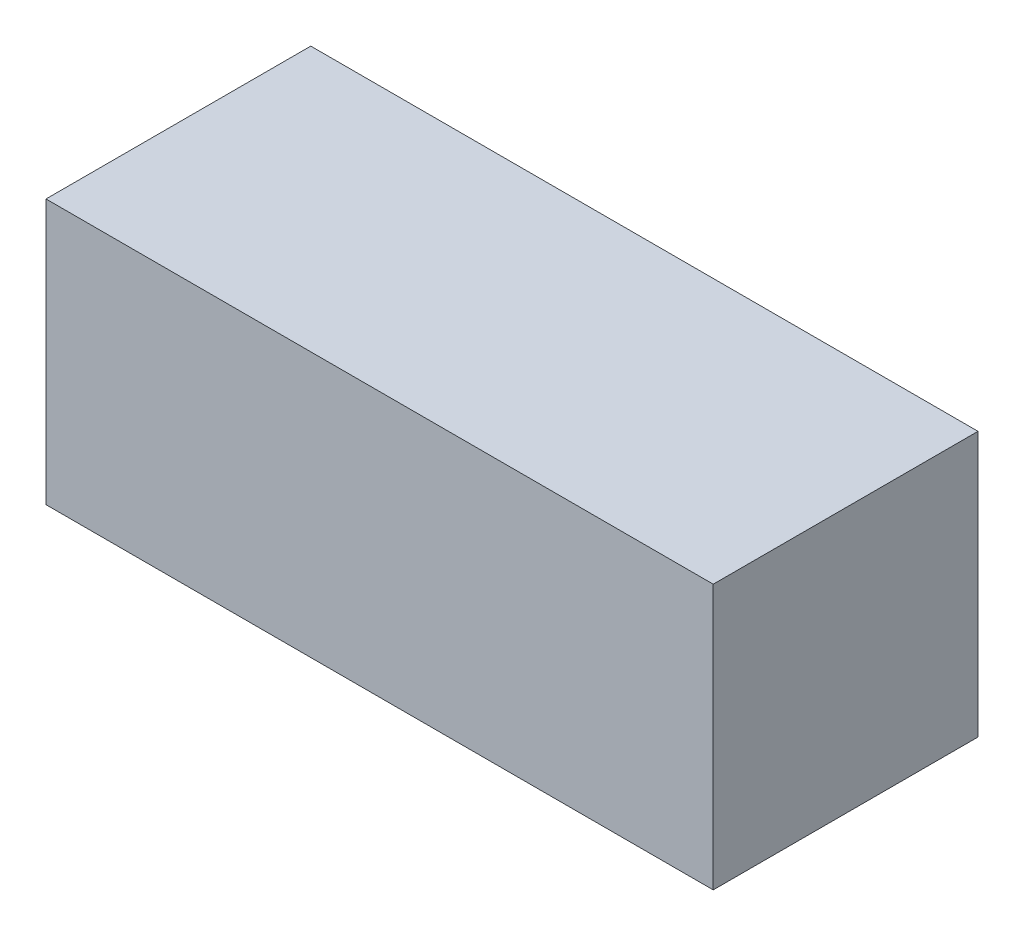
ISO-10303-21;
HEADER;
FILE_DESCRIPTION(('STEP AP214'),'2;1');
FILE_NAME('part.step','',(''),(''),'','','');
FILE_SCHEMA(('AUTOMOTIVE_DESIGN { 1 0 10303 214 1 1 1 1 }'));
ENDSEC;
DATA;
#1=APPLICATION_CONTEXT('core data for automotive mechanical design processes');
#2=APPLICATION_PROTOCOL_DEFINITION('international standard','automotive_design',2000,#1);
#3=PRODUCT_CONTEXT('',#1,'mechanical');
#4=PRODUCT('Part','Part','',(#3));
#5=PRODUCT_RELATED_PRODUCT_CATEGORY('part','',(#4));
#6=PRODUCT_DEFINITION_FORMATION('','',#4);
#7=PRODUCT_DEFINITION_CONTEXT('part definition',#1,'design');
#8=PRODUCT_DEFINITION('design','',#6,#7);
#9=PRODUCT_DEFINITION_SHAPE('','',#8);
#10=(LENGTH_UNIT() NAMED_UNIT(*) SI_UNIT(.MILLI.,.METRE.));
#11=(NAMED_UNIT(*) PLANE_ANGLE_UNIT() SI_UNIT($,.RADIAN.));
#12=(NAMED_UNIT(*) SI_UNIT($,.STERADIAN.) SOLID_ANGLE_UNIT());
#13=UNCERTAINTY_MEASURE_WITH_UNIT(LENGTH_MEASURE(1.E-05),#10,'distance_accuracy_value','');
#14=(GEOMETRIC_REPRESENTATION_CONTEXT(3) GLOBAL_UNCERTAINTY_ASSIGNED_CONTEXT((#13)) GLOBAL_UNIT_ASSIGNED_CONTEXT((#10,
#11,#12)) REPRESENTATION_CONTEXT('',''));
#15=CARTESIAN_POINT('',(0.,0.,0.));
#16=DIRECTION('',(0.,0.,1.));
#17=DIRECTION('',(1.,0.,0.));
#18=AXIS2_PLACEMENT_3D('',#15,#16,#17);
#19=CARTESIAN_POINT('',(31.5,25.,12.5));
#20=DIRECTION('',(-1.,0.,0.));
#21=DIRECTION('',(0.,0.,1.));
#22=AXIS2_PLACEMENT_3D('',#19,#20,#21);
#23=PLANE('',#22);
#24=DIRECTION('',(0.,0.,-1.));
#25=VECTOR('',#24,1.);
#26=CARTESIAN_POINT('',(31.5,0.,12.5));
#27=LINE('',#26,#25);
#28=CARTESIAN_POINT('',(31.5,0.,12.5));
#29=VERTEX_POINT('',#28);
#30=CARTESIAN_POINT('',(31.5,0.,-12.5));
#31=VERTEX_POINT('',#30);
#32=EDGE_CURVE('E107',#29,#31,#27,.T.);
#33=ORIENTED_EDGE('',*,*,#32,.T.);
#34=DIRECTION('',(0.,-1.,0.));
#35=VECTOR('',#34,1.);
#36=CARTESIAN_POINT('',(31.5,25.,-12.5));
#37=LINE('',#36,#35);
#38=CARTESIAN_POINT('',(31.5,25.,-12.5));
#39=VERTEX_POINT('',#38);
#40=EDGE_CURVE('E11',#39,#31,#37,.T.);
#41=ORIENTED_EDGE('',*,*,#40,.F.);
#42=DIRECTION('',(0.,0.,-1.));
#43=VECTOR('',#42,1.);
#44=CARTESIAN_POINT('',(31.5,25.,12.5));
#45=LINE('',#44,#43);
#46=CARTESIAN_POINT('',(31.5,25.,12.5));
#47=VERTEX_POINT('',#46);
#48=EDGE_CURVE('E91',#47,#39,#45,.T.);
#49=ORIENTED_EDGE('',*,*,#48,.F.);
#50=DIRECTION('',(0.,-1.,0.));
#51=VECTOR('',#50,1.);
#52=CARTESIAN_POINT('',(31.5,25.,12.5));
#53=LINE('',#52,#51);
#54=EDGE_CURVE('E103',#47,#29,#53,.T.);
#55=ORIENTED_EDGE('',*,*,#54,.T.);
#56=EDGE_LOOP('',(#33,#41,#49,#55));
#57=FACE_BOUND('',#56,.T.);
#58=ADVANCED_FACE('F39',(#57),#23,.F.);
#59=CARTESIAN_POINT('',(-31.5,25.,-12.5));
#60=DIRECTION('',(0.,0.,1.));
#61=DIRECTION('',(1.,0.,0.));
#62=AXIS2_PLACEMENT_3D('',#59,#60,#61);
#63=PLANE('',#62);
#64=DIRECTION('',(-1.,0.,0.));
#65=VECTOR('',#64,1.);
#66=CARTESIAN_POINT('',(-31.5,0.,-12.5));
#67=LINE('',#66,#65);
#68=CARTESIAN_POINT('',(-31.5,0.,-12.5));
#69=VERTEX_POINT('',#68);
#70=EDGE_CURVE('E96',#31,#69,#67,.T.);
#71=ORIENTED_EDGE('',*,*,#70,.T.);
#72=DIRECTION('',(0.,-1.,0.));
#73=VECTOR('',#72,1.);
#74=CARTESIAN_POINT('',(-31.5,25.,-12.5));
#75=LINE('',#74,#73);
#76=CARTESIAN_POINT('',(-31.5,25.,-12.5));
#77=VERTEX_POINT('',#76);
#78=EDGE_CURVE('E48',#77,#69,#75,.T.);
#79=ORIENTED_EDGE('',*,*,#78,.F.);
#80=DIRECTION('',(-1.,0.,0.));
#81=VECTOR('',#80,1.);
#82=CARTESIAN_POINT('',(-31.5,25.,-12.5));
#83=LINE('',#82,#81);
#84=EDGE_CURVE('E86',#39,#77,#83,.T.);
#85=ORIENTED_EDGE('',*,*,#84,.F.);
#86=ORIENTED_EDGE('',*,*,#40,.T.);
#87=EDGE_LOOP('',(#71,#79,#85,#86));
#88=FACE_BOUND('',#87,.T.);
#89=ADVANCED_FACE('F95',(#88),#63,.F.);
#90=CARTESIAN_POINT('',(-31.5,25.,12.5));
#91=DIRECTION('',(1.,0.,0.));
#92=DIRECTION('',(0.,0.,-1.));
#93=AXIS2_PLACEMENT_3D('',#90,#91,#92);
#94=PLANE('',#93);
#95=DIRECTION('',(0.,0.,1.));
#96=VECTOR('',#95,1.);
#97=CARTESIAN_POINT('',(-31.5,0.,12.5));
#98=LINE('',#97,#96);
#99=CARTESIAN_POINT('',(-31.5,0.,12.5));
#100=VERTEX_POINT('',#99);
#101=EDGE_CURVE('E73',#69,#100,#98,.T.);
#102=ORIENTED_EDGE('',*,*,#101,.T.);
#103=DIRECTION('',(0.,-1.,0.));
#104=VECTOR('',#103,1.);
#105=CARTESIAN_POINT('',(-31.5,25.,12.5));
#106=LINE('',#105,#104);
#107=CARTESIAN_POINT('',(-31.5,25.,12.5));
#108=VERTEX_POINT('',#107);
#109=EDGE_CURVE('E98',#108,#100,#106,.T.);
#110=ORIENTED_EDGE('',*,*,#109,.F.);
#111=DIRECTION('',(0.,0.,1.));
#112=VECTOR('',#111,1.);
#113=CARTESIAN_POINT('',(-31.5,25.,12.5));
#114=LINE('',#113,#112);
#115=EDGE_CURVE('E89',#77,#108,#114,.T.);
#116=ORIENTED_EDGE('',*,*,#115,.F.);
#117=ORIENTED_EDGE('',*,*,#78,.T.);
#118=EDGE_LOOP('',(#102,#110,#116,#117));
#119=FACE_BOUND('',#118,.T.);
#120=ADVANCED_FACE('F99',(#119),#94,.F.);
#121=CARTESIAN_POINT('',(-31.5,25.,12.5));
#122=DIRECTION('',(0.,0.,-1.));
#123=DIRECTION('',(-1.,0.,0.));
#124=AXIS2_PLACEMENT_3D('',#121,#122,#123);
#125=PLANE('',#124);
#126=DIRECTION('',(1.,0.,0.));
#127=VECTOR('',#126,1.);
#128=CARTESIAN_POINT('',(-31.5,0.,12.5));
#129=LINE('',#128,#127);
#130=EDGE_CURVE('E79',#100,#29,#129,.T.);
#131=ORIENTED_EDGE('',*,*,#130,.T.);
#132=ORIENTED_EDGE('',*,*,#54,.F.);
#133=DIRECTION('',(1.,0.,0.));
#134=VECTOR('',#133,1.);
#135=CARTESIAN_POINT('',(-31.5,25.,12.5));
#136=LINE('',#135,#134);
#137=EDGE_CURVE('E56',#108,#47,#136,.T.);
#138=ORIENTED_EDGE('',*,*,#137,.F.);
#139=ORIENTED_EDGE('',*,*,#109,.T.);
#140=EDGE_LOOP('',(#131,#132,#138,#139));
#141=FACE_BOUND('',#140,.T.);
#142=ADVANCED_FACE('F120',(#141),#125,.F.);
#143=CARTESIAN_POINT('',(0.,25.,0.));
#144=DIRECTION('',(0.,-1.,0.));
#145=DIRECTION('',(0.,0.,-1.));
#146=AXIS2_PLACEMENT_3D('',#143,#144,#145);
#147=PLANE('',#146);
#148=ORIENTED_EDGE('',*,*,#48,.T.);
#149=ORIENTED_EDGE('',*,*,#84,.T.);
#150=ORIENTED_EDGE('',*,*,#115,.T.);
#151=ORIENTED_EDGE('',*,*,#137,.T.);
#152=EDGE_LOOP('',(#148,#149,#150,#151));
#153=FACE_BOUND('',#152,.T.);
#154=ADVANCED_FACE('F87',(#153),#147,.F.);
#155=CARTESIAN_POINT('',(0.,0.,0.));
#156=DIRECTION('',(0.,-1.,0.));
#157=DIRECTION('',(0.,0.,-1.));
#158=AXIS2_PLACEMENT_3D('',#155,#156,#157);
#159=PLANE('',#158);
#160=ORIENTED_EDGE('',*,*,#32,.F.);
#161=ORIENTED_EDGE('',*,*,#130,.F.);
#162=ORIENTED_EDGE('',*,*,#101,.F.);
#163=ORIENTED_EDGE('',*,*,#70,.F.);
#164=EDGE_LOOP('',(#160,#161,#162,#163));
#165=FACE_BOUND('',#164,.T.);
#166=ADVANCED_FACE('F123',(#165),#159,.T.);
#167=CLOSED_SHELL('',(#58,#89,#120,#142,#154,#166));
#168=MANIFOLD_SOLID_BREP('B2',#167);
#169=ADVANCED_BREP_SHAPE_REPRESENTATION('',(#18,#168),#14);
#170=SHAPE_DEFINITION_REPRESENTATION(#9,#169);
ENDSEC;
END-ISO-10303-21;
